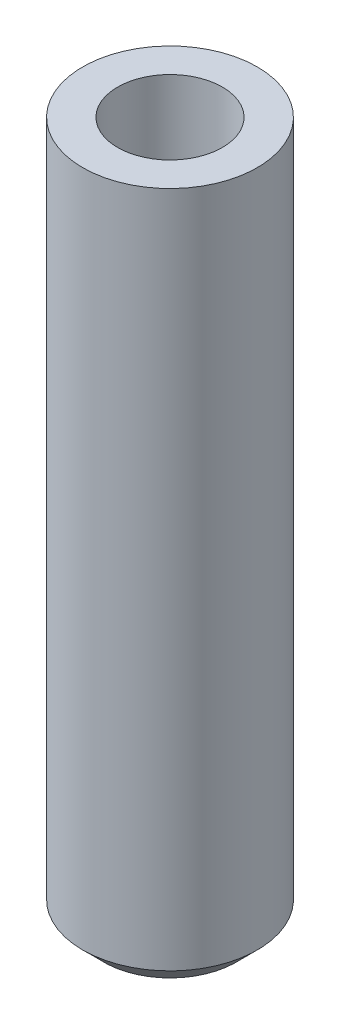
ISO-10303-21;
HEADER;
FILE_DESCRIPTION(('STEP AP214'),'2;1');
FILE_NAME('part.step','',(''),(''),'','','');
FILE_SCHEMA(('AUTOMOTIVE_DESIGN { 1 0 10303 214 1 1 1 1 }'));
ENDSEC;
DATA;
#1=APPLICATION_CONTEXT('core data for automotive mechanical design processes');
#2=APPLICATION_PROTOCOL_DEFINITION('international standard','automotive_design',2000,#1);
#3=PRODUCT_CONTEXT('',#1,'mechanical');
#4=PRODUCT('Part','Part','',(#3));
#5=PRODUCT_RELATED_PRODUCT_CATEGORY('part','',(#4));
#6=PRODUCT_DEFINITION_FORMATION('','',#4);
#7=PRODUCT_DEFINITION_CONTEXT('part definition',#1,'design');
#8=PRODUCT_DEFINITION('design','',#6,#7);
#9=PRODUCT_DEFINITION_SHAPE('','',#8);
#10=(LENGTH_UNIT() NAMED_UNIT(*) SI_UNIT(.MILLI.,.METRE.));
#11=(NAMED_UNIT(*) PLANE_ANGLE_UNIT() SI_UNIT($,.RADIAN.));
#12=(NAMED_UNIT(*) SI_UNIT($,.STERADIAN.) SOLID_ANGLE_UNIT());
#13=UNCERTAINTY_MEASURE_WITH_UNIT(LENGTH_MEASURE(1.E-05),#10,'distance_accuracy_value','');
#14=(GEOMETRIC_REPRESENTATION_CONTEXT(3) GLOBAL_UNCERTAINTY_ASSIGNED_CONTEXT((#13)) GLOBAL_UNIT_ASSIGNED_CONTEXT((#10,
#11,#12)) REPRESENTATION_CONTEXT('',''));
#15=CARTESIAN_POINT('',(0.,0.,0.));
#16=DIRECTION('',(0.,0.,1.));
#17=DIRECTION('',(1.,0.,0.));
#18=AXIS2_PLACEMENT_3D('',#15,#16,#17);
#19=CARTESIAN_POINT('',(0.,0.,0.));
#20=DIRECTION('',(0.,-1.,0.));
#21=DIRECTION('',(0.,0.,-1.));
#22=AXIS2_PLACEMENT_3D('',#19,#20,#21);
#23=CYLINDRICAL_SURFACE('',#22,3.);
#24=CARTESIAN_POINT('',(0.,0.,0.));
#25=DIRECTION('',(0.,-1.,0.));
#26=DIRECTION('',(0.,0.,-1.));
#27=AXIS2_PLACEMENT_3D('',#24,#25,#26);
#28=CIRCLE('',#27,3.);
#29=CARTESIAN_POINT('',(0.,0.,-3.));
#30=VERTEX_POINT('',#29);
#31=EDGE_CURVE('E49',#30,#30,#28,.T.);
#32=ORIENTED_EDGE('',*,*,#31,.T.);
#33=EDGE_LOOP('',(#32));
#34=FACE_BOUND('',#33,.T.);
#35=CARTESIAN_POINT('',(0.,40.,0.));
#36=DIRECTION('',(0.,-1.,0.));
#37=DIRECTION('',(0.,0.,-1.));
#38=AXIS2_PLACEMENT_3D('',#35,#36,#37);
#39=CIRCLE('',#38,3.);
#40=CARTESIAN_POINT('',(0.,40.,-3.));
#41=VERTEX_POINT('',#40);
#42=EDGE_CURVE('E40',#41,#41,#39,.T.);
#43=ORIENTED_EDGE('',*,*,#42,.F.);
#44=EDGE_LOOP('',(#43));
#45=FACE_BOUND('',#44,.T.);
#46=ADVANCED_FACE('F29',(#34,#45),#23,.F.);
#47=CARTESIAN_POINT('',(3.,40.,0.));
#48=DIRECTION('',(0.,1.,0.));
#49=DIRECTION('',(0.,0.,1.));
#50=AXIS2_PLACEMENT_3D('',#47,#48,#49);
#51=PLANE('',#50);
#52=ORIENTED_EDGE('',*,*,#42,.T.);
#53=EDGE_LOOP('',(#52));
#54=FACE_BOUND('',#53,.T.);
#55=CARTESIAN_POINT('',(0.,40.,0.));
#56=DIRECTION('',(0.,-1.,0.));
#57=DIRECTION('',(0.,0.,-1.));
#58=AXIS2_PLACEMENT_3D('',#55,#56,#57);
#59=CIRCLE('',#58,5.);
#60=CARTESIAN_POINT('',(0.,40.,-5.));
#61=VERTEX_POINT('',#60);
#62=EDGE_CURVE('E44',#61,#61,#59,.T.);
#63=ORIENTED_EDGE('',*,*,#62,.F.);
#64=EDGE_LOOP('',(#63));
#65=FACE_BOUND('',#64,.T.);
#66=ADVANCED_FACE('F65',(#54,#65),#51,.T.);
#67=CARTESIAN_POINT('',(0.,0.,0.));
#68=DIRECTION('',(0.,-1.,0.));
#69=DIRECTION('',(0.,0.,-1.));
#70=AXIS2_PLACEMENT_3D('',#67,#68,#69);
#71=CYLINDRICAL_SURFACE('',#70,5.);
#72=CARTESIAN_POINT('',(0.,1.20000000000001,0.));
#73=DIRECTION('',(0.,-1.,0.));
#74=DIRECTION('',(0.,0.,-1.));
#75=AXIS2_PLACEMENT_3D('',#72,#73,#74);
#76=CIRCLE('',#75,5.);
#77=CARTESIAN_POINT('',(0.,1.20000000000001,-5.));
#78=VERTEX_POINT('',#77);
#79=EDGE_CURVE('E10',#78,#78,#76,.F.);
#80=ORIENTED_EDGE('',*,*,#79,.T.);
#81=EDGE_LOOP('',(#80));
#82=FACE_BOUND('',#81,.T.);
#83=ORIENTED_EDGE('',*,*,#62,.T.);
#84=EDGE_LOOP('',(#83));
#85=FACE_BOUND('',#84,.T.);
#86=ADVANCED_FACE('F57',(#82,#85),#71,.T.);
#87=CARTESIAN_POINT('',(3.,0.,0.));
#88=DIRECTION('',(0.,-1.,0.));
#89=DIRECTION('',(0.,0.,-1.));
#90=AXIS2_PLACEMENT_3D('',#87,#88,#89);
#91=PLANE('',#90);
#92=CARTESIAN_POINT('',(0.,0.,0.));
#93=DIRECTION('',(0.,-1.,0.));
#94=DIRECTION('',(0.,0.,-1.));
#95=AXIS2_PLACEMENT_3D('',#92,#93,#94);
#96=CIRCLE('',#95,3.8);
#97=CARTESIAN_POINT('',(0.,0.,-3.8));
#98=VERTEX_POINT('',#97);
#99=EDGE_CURVE('E36',#98,#98,#96,.T.);
#100=ORIENTED_EDGE('',*,*,#99,.T.);
#101=EDGE_LOOP('',(#100));
#102=FACE_BOUND('',#101,.T.);
#103=ORIENTED_EDGE('',*,*,#31,.F.);
#104=EDGE_LOOP('',(#103));
#105=FACE_BOUND('',#104,.T.);
#106=ADVANCED_FACE('F55',(#102,#105),#91,.T.);
#107=CARTESIAN_POINT('',(0.,0.,0.));
#108=DIRECTION('',(0.,1.,0.));
#109=DIRECTION('',(0.,0.,1.));
#110=AXIS2_PLACEMENT_3D('',#107,#108,#109);
#111=CONICAL_SURFACE('',#110,3.8,0.785398163397446);
#112=ORIENTED_EDGE('',*,*,#79,.F.);
#113=EDGE_LOOP('',(#112));
#114=FACE_BOUND('',#113,.T.);
#115=ORIENTED_EDGE('',*,*,#99,.F.);
#116=EDGE_LOOP('',(#115));
#117=FACE_BOUND('',#116,.T.);
#118=ADVANCED_FACE('F31',(#114,#117),#111,.T.);
#119=CLOSED_SHELL('',(#46,#66,#86,#106,#118));
#120=MANIFOLD_SOLID_BREP('B2',#119);
#121=ADVANCED_BREP_SHAPE_REPRESENTATION('',(#18,#120),#14);
#122=SHAPE_DEFINITION_REPRESENTATION(#9,#121);
ENDSEC;
END-ISO-10303-21;
